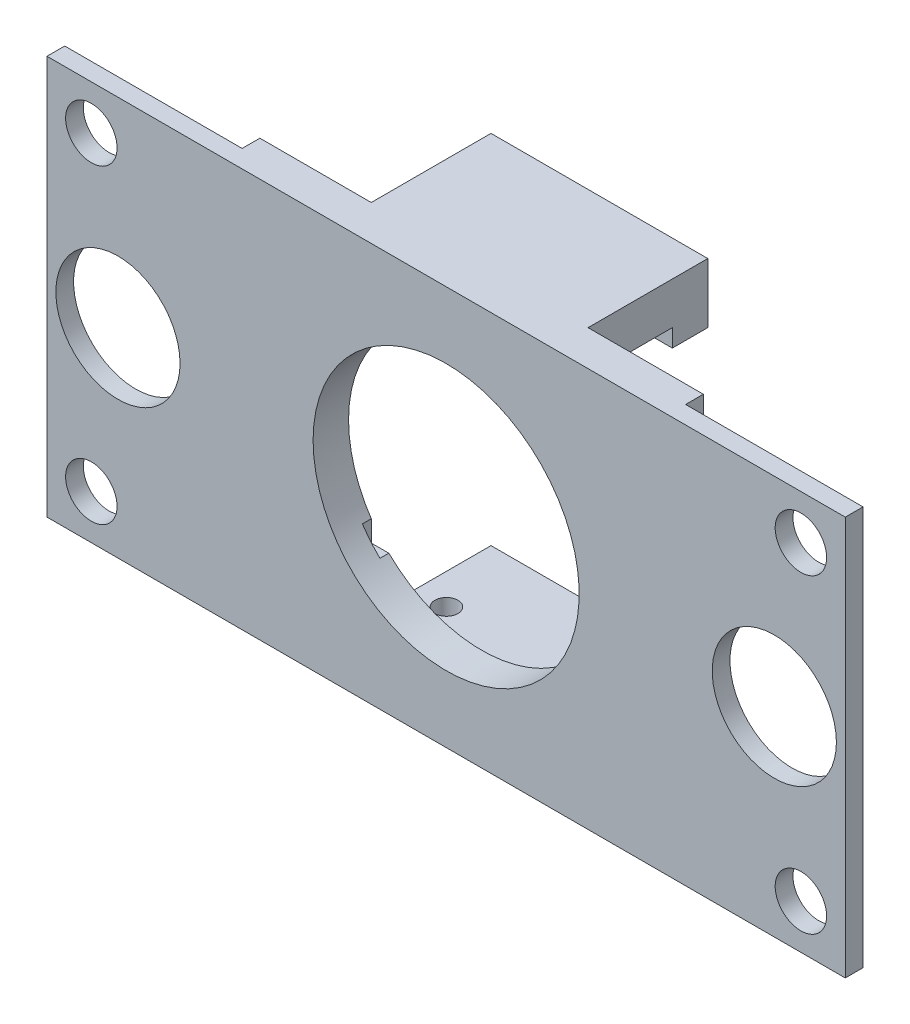
ISO-10303-21;
HEADER;
FILE_DESCRIPTION(('STEP AP214'),'2;1');
FILE_NAME('part.step','',(''),(''),'','','');
FILE_SCHEMA(('AUTOMOTIVE_DESIGN { 1 0 10303 214 1 1 1 1 }'));
ENDSEC;
DATA;
#1=APPLICATION_CONTEXT('core data for automotive mechanical design processes');
#2=APPLICATION_PROTOCOL_DEFINITION('international standard','automotive_design',2000,#1);
#3=PRODUCT_CONTEXT('',#1,'mechanical');
#4=PRODUCT('Part','Part','',(#3));
#5=PRODUCT_RELATED_PRODUCT_CATEGORY('part','',(#4));
#6=PRODUCT_DEFINITION_FORMATION('','',#4);
#7=PRODUCT_DEFINITION_CONTEXT('part definition',#1,'design');
#8=PRODUCT_DEFINITION('design','',#6,#7);
#9=PRODUCT_DEFINITION_SHAPE('','',#8);
#10=(LENGTH_UNIT() NAMED_UNIT(*) SI_UNIT(.MILLI.,.METRE.));
#11=(NAMED_UNIT(*) PLANE_ANGLE_UNIT() SI_UNIT($,.RADIAN.));
#12=(NAMED_UNIT(*) SI_UNIT($,.STERADIAN.) SOLID_ANGLE_UNIT());
#13=UNCERTAINTY_MEASURE_WITH_UNIT(LENGTH_MEASURE(1.E-05),#10,'distance_accuracy_value','');
#14=(GEOMETRIC_REPRESENTATION_CONTEXT(3) GLOBAL_UNCERTAINTY_ASSIGNED_CONTEXT((#13)) GLOBAL_UNIT_ASSIGNED_CONTEXT((#10,
#11,#12)) REPRESENTATION_CONTEXT('',''));
#15=CARTESIAN_POINT('',(0.,0.,0.));
#16=DIRECTION('',(0.,0.,1.));
#17=DIRECTION('',(1.,0.,0.));
#18=AXIS2_PLACEMENT_3D('',#15,#16,#17);
#19=CARTESIAN_POINT('',(0.,17.75,-17.5));
#20=DIRECTION('',(0.,1.,0.));
#21=DIRECTION('',(0.,0.,1.));
#22=AXIS2_PLACEMENT_3D('',#19,#20,#21);
#23=PLANE('',#22);
#24=DIRECTION('',(-1.,0.,0.));
#25=VECTOR('',#24,1.);
#26=CARTESIAN_POINT('',(-12.44124124824,17.75,-13.5));
#27=LINE('',#26,#25);
#28=CARTESIAN_POINT('',(12.,17.75,-13.5));
#29=VERTEX_POINT('',#28);
#30=CARTESIAN_POINT('',(-12.44124124824,17.75,-13.5));
#31=VERTEX_POINT('',#30);
#32=EDGE_CURVE('E225',#29,#31,#27,.T.);
#33=ORIENTED_EDGE('',*,*,#32,.F.);
#34=DIRECTION('',(0.,0.,1.));
#35=VECTOR('',#34,1.);
#36=CARTESIAN_POINT('',(12.,17.75,-17.5));
#37=LINE('',#36,#35);
#38=CARTESIAN_POINT('',(12.,17.75,-4.));
#39=VERTEX_POINT('',#38);
#40=EDGE_CURVE('E52',#29,#39,#37,.T.);
#41=ORIENTED_EDGE('',*,*,#40,.T.);
#42=DIRECTION('',(-1.,0.,0.));
#43=VECTOR('',#42,1.);
#44=CARTESIAN_POINT('',(0.,17.75,-4.));
#45=LINE('',#44,#43);
#46=CARTESIAN_POINT('',(-12.44124124824,17.75,-4.));
#47=VERTEX_POINT('',#46);
#48=EDGE_CURVE('E242',#39,#47,#45,.T.);
#49=ORIENTED_EDGE('',*,*,#48,.T.);
#50=DIRECTION('',(0.,0.,1.));
#51=VECTOR('',#50,1.);
#52=CARTESIAN_POINT('',(-12.44124124824,17.75,-17.5));
#53=LINE('',#52,#51);
#54=EDGE_CURVE('E60',#31,#47,#53,.T.);
#55=ORIENTED_EDGE('',*,*,#54,.F.);
#56=EDGE_LOOP('',(#33,#41,#49,#55));
#57=FACE_BOUND('',#56,.T.);
#58=ADVANCED_FACE('F37',(#57),#23,.F.);
#59=CARTESIAN_POINT('',(0.,0.,-4.));
#60=DIRECTION('',(0.,0.,1.));
#61=DIRECTION('',(1.,0.,0.));
#62=AXIS2_PLACEMENT_3D('',#59,#60,#61);
#63=PLANE('',#62);
#64=DIRECTION('',(0.,-1.,0.));
#65=VECTOR('',#64,1.);
#66=CARTESIAN_POINT('',(-12.44124124824,0.,-4.));
#67=LINE('',#66,#65);
#68=CARTESIAN_POINT('',(-12.44124124824,-8.37946992375366,-4.));
#69=VERTEX_POINT('',#68);
#70=CARTESIAN_POINT('',(-12.44124124824,-10.75,-4.));
#71=VERTEX_POINT('',#70);
#72=EDGE_CURVE('E291',#69,#71,#67,.T.);
#73=ORIENTED_EDGE('',*,*,#72,.T.);
#74=DIRECTION('',(-1.,0.,0.));
#75=VECTOR('',#74,1.);
#76=CARTESIAN_POINT('',(0.,-10.75,-4.));
#77=LINE('',#76,#75);
#78=CARTESIAN_POINT('',(-10.4612379764538,-10.75,-4.));
#79=VERTEX_POINT('',#78);
#80=EDGE_CURVE('E308',#79,#71,#77,.T.);
#81=ORIENTED_EDGE('',*,*,#80,.F.);
#82=CARTESIAN_POINT('',(0.,0.,-4.));
#83=DIRECTION('',(0.,0.,-1.));
#84=DIRECTION('',(-1.,0.,0.));
#85=AXIS2_PLACEMENT_3D('',#82,#83,#84);
#86=CIRCLE('',#85,15.);
#87=CARTESIAN_POINT('',(10.4612379764538,-10.75,-4.));
#88=VERTEX_POINT('',#87);
#89=EDGE_CURVE('E319',#88,#79,#86,.T.);
#90=ORIENTED_EDGE('',*,*,#89,.F.);
#91=CARTESIAN_POINT('',(12.,-10.75,-4.));
#92=VERTEX_POINT('',#91);
#93=EDGE_CURVE('E296',#92,#88,#77,.T.);
#94=ORIENTED_EDGE('',*,*,#93,.F.);
#95=DIRECTION('',(0.,1.,0.));
#96=VECTOR('',#95,1.);
#97=CARTESIAN_POINT('',(12.,0.,-4.));
#98=LINE('',#97,#96);
#99=CARTESIAN_POINT('',(12.,-9.,-4.));
#100=VERTEX_POINT('',#99);
#101=EDGE_CURVE('E305',#92,#100,#98,.T.);
#102=ORIENTED_EDGE('',*,*,#101,.T.);
#103=EDGE_CURVE('E313',#69,#100,#86,.T.);
#104=ORIENTED_EDGE('',*,*,#103,.F.);
#105=EDGE_LOOP('',(#73,#81,#90,#94,#102,#104));
#106=FACE_BOUND('',#105,.T.);
#107=DIRECTION('',(0.,-1.,0.));
#108=VECTOR('',#107,1.);
#109=CARTESIAN_POINT('',(12.,0.,-4.));
#110=LINE('',#109,#108);
#111=CARTESIAN_POINT('',(12.,22.5,-4.));
#112=VERTEX_POINT('',#111);
#113=EDGE_CURVE('E235',#112,#39,#110,.T.);
#114=ORIENTED_EDGE('',*,*,#113,.F.);
#115=DIRECTION('',(1.,0.,0.));
#116=VECTOR('',#115,1.);
#117=CARTESIAN_POINT('',(25.,22.5,-4.));
#118=LINE('',#117,#116);
#119=CARTESIAN_POINT('',(25.,22.5,-4.));
#120=VERTEX_POINT('',#119);
#121=EDGE_CURVE('E328',#112,#120,#118,.T.);
#122=ORIENTED_EDGE('',*,*,#121,.T.);
#123=DIRECTION('',(0.,-1.,0.));
#124=VECTOR('',#123,1.);
#125=CARTESIAN_POINT('',(25.,-22.5,-4.));
#126=LINE('',#125,#124);
#127=CARTESIAN_POINT('',(25.,-22.5,-4.));
#128=VERTEX_POINT('',#127);
#129=EDGE_CURVE('E331',#120,#128,#126,.T.);
#130=ORIENTED_EDGE('',*,*,#129,.T.);
#131=DIRECTION('',(-1.,0.,0.));
#132=VECTOR('',#131,1.);
#133=CARTESIAN_POINT('',(-25.,-22.5,-4.));
#134=LINE('',#133,#132);
#135=CARTESIAN_POINT('',(12.,-22.5,-4.));
#136=VERTEX_POINT('',#135);
#137=EDGE_CURVE('E322',#128,#136,#134,.T.);
#138=ORIENTED_EDGE('',*,*,#137,.T.);
#139=DIRECTION('',(0.,1.,0.));
#140=VECTOR('',#139,1.);
#141=CARTESIAN_POINT('',(12.,0.,-4.));
#142=LINE('',#141,#140);
#143=CARTESIAN_POINT('',(12.,-17.75,-4.));
#144=VERTEX_POINT('',#143);
#145=EDGE_CURVE('E278',#136,#144,#142,.T.);
#146=ORIENTED_EDGE('',*,*,#145,.T.);
#147=DIRECTION('',(-1.,0.,0.));
#148=VECTOR('',#147,1.);
#149=CARTESIAN_POINT('',(0.,-17.75,-4.));
#150=LINE('',#149,#148);
#151=CARTESIAN_POINT('',(-12.44124124824,-17.75,-4.));
#152=VERTEX_POINT('',#151);
#153=EDGE_CURVE('E260',#144,#152,#150,.T.);
#154=ORIENTED_EDGE('',*,*,#153,.T.);
#155=DIRECTION('',(0.,-1.,0.));
#156=VECTOR('',#155,1.);
#157=CARTESIAN_POINT('',(-12.44124124824,0.,-4.));
#158=LINE('',#157,#156);
#159=CARTESIAN_POINT('',(-12.44124124824,-22.5,-4.));
#160=VERTEX_POINT('',#159);
#161=EDGE_CURVE('E267',#152,#160,#158,.T.);
#162=ORIENTED_EDGE('',*,*,#161,.T.);
#163=CARTESIAN_POINT('',(-25.,-22.5,-4.));
#164=VERTEX_POINT('',#163);
#165=EDGE_CURVE('E326',#160,#164,#134,.T.);
#166=ORIENTED_EDGE('',*,*,#165,.T.);
#167=DIRECTION('',(0.,1.,0.));
#168=VECTOR('',#167,1.);
#169=CARTESIAN_POINT('',(-25.,22.5,-4.));
#170=LINE('',#169,#168);
#171=CARTESIAN_POINT('',(-25.,22.5,-4.));
#172=VERTEX_POINT('',#171);
#173=EDGE_CURVE('E325',#164,#172,#170,.T.);
#174=ORIENTED_EDGE('',*,*,#173,.T.);
#175=CARTESIAN_POINT('',(-12.44124124824,22.5,-4.));
#176=VERTEX_POINT('',#175);
#177=EDGE_CURVE('E329',#172,#176,#118,.T.);
#178=ORIENTED_EDGE('',*,*,#177,.T.);
#179=DIRECTION('',(0.,1.,0.));
#180=VECTOR('',#179,1.);
#181=CARTESIAN_POINT('',(-12.44124124824,0.,-4.));
#182=LINE('',#181,#180);
#183=EDGE_CURVE('E236',#47,#176,#182,.T.);
#184=ORIENTED_EDGE('',*,*,#183,.F.);
#185=ORIENTED_EDGE('',*,*,#48,.F.);
#186=EDGE_LOOP('',(#114,#122,#130,#138,#146,#154,#162,#166,#174,#178,#184,#185));
#187=FACE_BOUND('',#186,.T.);
#188=ADVANCED_FACE('F444',(#106,#187),#63,.F.);
#189=CARTESIAN_POINT('',(0.,0.,0.));
#190=DIRECTION('',(0.,0.,-1.));
#191=DIRECTION('',(-1.,0.,0.));
#192=AXIS2_PLACEMENT_3D('',#189,#190,#191);
#193=CYLINDRICAL_SURFACE('',#192,15.);
#194=CARTESIAN_POINT('',(0.,0.,0.));
#195=DIRECTION('',(0.,0.,-1.));
#196=DIRECTION('',(-1.,0.,0.));
#197=AXIS2_PLACEMENT_3D('',#194,#195,#196);
#198=CIRCLE('',#197,15.);
#199=CARTESIAN_POINT('',(-15.,0.,0.));
#200=VERTEX_POINT('',#199);
#201=EDGE_CURVE('E315',#200,#200,#198,.T.);
#202=ORIENTED_EDGE('',*,*,#201,.F.);
#203=EDGE_LOOP('',(#202));
#204=FACE_BOUND('',#203,.T.);
#205=DIRECTION('',(0.,0.,-1.));
#206=VECTOR('',#205,1.);
#207=CARTESIAN_POINT('',(-12.44124124824,-8.37946992375366,0.));
#208=LINE('',#207,#206);
#209=CARTESIAN_POINT('',(-12.44124124824,-8.37946992375366,-3.));
#210=VERTEX_POINT('',#209);
#211=EDGE_CURVE('E11',#69,#210,#208,.F.);
#212=ORIENTED_EDGE('',*,*,#211,.F.);
#213=ORIENTED_EDGE('',*,*,#103,.T.);
#214=DIRECTION('',(0.,0.,-1.));
#215=VECTOR('',#214,1.);
#216=CARTESIAN_POINT('',(12.,-9.,0.));
#217=LINE('',#216,#215);
#218=CARTESIAN_POINT('',(12.,-9.,-3.));
#219=VERTEX_POINT('',#218);
#220=EDGE_CURVE('E423',#219,#100,#217,.T.);
#221=ORIENTED_EDGE('',*,*,#220,.F.);
#222=CARTESIAN_POINT('',(0.,0.,-3.));
#223=DIRECTION('',(0.,0.,-1.));
#224=DIRECTION('',(-1.,0.,0.));
#225=AXIS2_PLACEMENT_3D('',#222,#223,#224);
#226=CIRCLE('',#225,15.);
#227=CARTESIAN_POINT('',(10.4612379764538,-10.75,-3.));
#228=VERTEX_POINT('',#227);
#229=EDGE_CURVE('E416',#228,#219,#226,.F.);
#230=ORIENTED_EDGE('',*,*,#229,.F.);
#231=DIRECTION('',(0.,0.,-1.));
#232=VECTOR('',#231,1.);
#233=CARTESIAN_POINT('',(10.4612379764538,-10.75,0.));
#234=LINE('',#233,#232);
#235=EDGE_CURVE('E426',#228,#88,#234,.T.);
#236=ORIENTED_EDGE('',*,*,#235,.T.);
#237=ORIENTED_EDGE('',*,*,#89,.T.);
#238=DIRECTION('',(0.,0.,-1.));
#239=VECTOR('',#238,1.);
#240=CARTESIAN_POINT('',(-10.4612379764538,-10.75,0.));
#241=LINE('',#240,#239);
#242=CARTESIAN_POINT('',(-10.4612379764538,-10.75,-3.));
#243=VERTEX_POINT('',#242);
#244=EDGE_CURVE('E45',#79,#243,#241,.F.);
#245=ORIENTED_EDGE('',*,*,#244,.T.);
#246=EDGE_CURVE('E424',#210,#243,#226,.F.);
#247=ORIENTED_EDGE('',*,*,#246,.F.);
#248=EDGE_LOOP('',(#212,#213,#221,#230,#236,#237,#245,#247));
#249=FACE_BOUND('',#248,.T.);
#250=ADVANCED_FACE('F450',(#204,#249),#193,.F.);
#251=CARTESIAN_POINT('',(0.,0.,-2.));
#252=DIRECTION('',(0.,0.,1.));
#253=DIRECTION('',(1.,0.,0.));
#254=AXIS2_PLACEMENT_3D('',#251,#252,#253);
#255=PLANE('',#254);
#256=CARTESIAN_POINT('',(-40.,17.5,-2.));
#257=DIRECTION('',(0.,0.,1.));
#258=DIRECTION('',(1.,0.,0.));
#259=AXIS2_PLACEMENT_3D('',#256,#257,#258);
#260=CIRCLE('',#259,2.9);
#261=CARTESIAN_POINT('',(-37.1,17.5,-2.));
#262=VERTEX_POINT('',#261);
#263=EDGE_CURVE('E382',#262,#262,#260,.T.);
#264=ORIENTED_EDGE('',*,*,#263,.T.);
#265=EDGE_LOOP('',(#264));
#266=FACE_BOUND('',#265,.T.);
#267=CARTESIAN_POINT('',(-40.,-17.5000000000001,-2.));
#268=DIRECTION('',(0.,0.,1.));
#269=DIRECTION('',(1.,0.,0.));
#270=AXIS2_PLACEMENT_3D('',#267,#268,#269);
#271=CIRCLE('',#270,2.9);
#272=CARTESIAN_POINT('',(-37.1,-17.5000000000001,-2.));
#273=VERTEX_POINT('',#272);
#274=EDGE_CURVE('E376',#273,#273,#271,.T.);
#275=ORIENTED_EDGE('',*,*,#274,.T.);
#276=EDGE_LOOP('',(#275));
#277=FACE_BOUND('',#276,.T.);
#278=CARTESIAN_POINT('',(-37.,0.,-2.));
#279=DIRECTION('',(0.,0.,1.));
#280=DIRECTION('',(1.,0.,0.));
#281=AXIS2_PLACEMENT_3D('',#278,#279,#280);
#282=CIRCLE('',#281,7.);
#283=CARTESIAN_POINT('',(-30.,0.,-2.));
#284=VERTEX_POINT('',#283);
#285=EDGE_CURVE('E358',#284,#284,#282,.T.);
#286=ORIENTED_EDGE('',*,*,#285,.T.);
#287=EDGE_LOOP('',(#286));
#288=FACE_BOUND('',#287,.T.);
#289=DIRECTION('',(0.,1.,0.));
#290=VECTOR('',#289,1.);
#291=CARTESIAN_POINT('',(-25.,22.5,-2.));
#292=LINE('',#291,#290);
#293=CARTESIAN_POINT('',(-25.,-22.5,-2.));
#294=VERTEX_POINT('',#293);
#295=CARTESIAN_POINT('',(-25.,22.5,-2.));
#296=VERTEX_POINT('',#295);
#297=EDGE_CURVE('E318',#294,#296,#292,.T.);
#298=ORIENTED_EDGE('',*,*,#297,.F.);
#299=DIRECTION('',(1.,0.,0.));
#300=VECTOR('',#299,1.);
#301=CARTESIAN_POINT('',(-45.,-22.5,-2.));
#302=LINE('',#301,#300);
#303=CARTESIAN_POINT('',(-45.,-22.5,-2.));
#304=VERTEX_POINT('',#303);
#305=EDGE_CURVE('E400',#304,#294,#302,.T.);
#306=ORIENTED_EDGE('',*,*,#305,.F.);
#307=DIRECTION('',(0.,-1.,0.));
#308=VECTOR('',#307,1.);
#309=CARTESIAN_POINT('',(-45.,22.5,-2.));
#310=LINE('',#309,#308);
#311=CARTESIAN_POINT('',(-45.,22.5,-2.));
#312=VERTEX_POINT('',#311);
#313=EDGE_CURVE('E396',#312,#304,#310,.T.);
#314=ORIENTED_EDGE('',*,*,#313,.F.);
#315=DIRECTION('',(-1.,0.,0.));
#316=VECTOR('',#315,1.);
#317=CARTESIAN_POINT('',(-45.,22.5,-2.));
#318=LINE('',#317,#316);
#319=EDGE_CURVE('E391',#296,#312,#318,.T.);
#320=ORIENTED_EDGE('',*,*,#319,.F.);
#321=EDGE_LOOP('',(#298,#306,#314,#320));
#322=FACE_BOUND('',#321,.T.);
#323=ADVANCED_FACE('F550',(#266,#277,#288,#322),#255,.F.);
#324=CARTESIAN_POINT('',(40.0000000000001,17.5,-2.));
#325=DIRECTION('',(0.,0.,1.));
#326=DIRECTION('',(1.,0.,0.));
#327=AXIS2_PLACEMENT_3D('',#324,#325,#326);
#328=CIRCLE('',#327,2.9);
#329=CARTESIAN_POINT('',(42.9000000000001,17.5,-2.));
#330=VERTEX_POINT('',#329);
#331=EDGE_CURVE('E370',#330,#330,#328,.T.);
#332=ORIENTED_EDGE('',*,*,#331,.T.);
#333=EDGE_LOOP('',(#332));
#334=FACE_BOUND('',#333,.T.);
#335=CARTESIAN_POINT('',(40.0000000000001,-17.5000000000001,-2.));
#336=DIRECTION('',(0.,0.,1.));
#337=DIRECTION('',(1.,0.,0.));
#338=AXIS2_PLACEMENT_3D('',#335,#336,#337);
#339=CIRCLE('',#338,2.9);
#340=CARTESIAN_POINT('',(42.9000000000001,-17.5000000000001,-2.));
#341=VERTEX_POINT('',#340);
#342=EDGE_CURVE('E364',#341,#341,#339,.T.);
#343=ORIENTED_EDGE('',*,*,#342,.T.);
#344=EDGE_LOOP('',(#343));
#345=FACE_BOUND('',#344,.T.);
#346=CARTESIAN_POINT('',(37.,0.,-2.));
#347=DIRECTION('',(0.,0.,1.));
#348=DIRECTION('',(1.,0.,0.));
#349=AXIS2_PLACEMENT_3D('',#346,#347,#348);
#350=CIRCLE('',#349,7.);
#351=CARTESIAN_POINT('',(44.,0.,-2.));
#352=VERTEX_POINT('',#351);
#353=EDGE_CURVE('E352',#352,#352,#350,.T.);
#354=ORIENTED_EDGE('',*,*,#353,.T.);
#355=EDGE_LOOP('',(#354));
#356=FACE_BOUND('',#355,.T.);
#357=DIRECTION('',(0.,-1.,0.));
#358=VECTOR('',#357,1.);
#359=CARTESIAN_POINT('',(25.,-22.5,-2.));
#360=LINE('',#359,#358);
#361=CARTESIAN_POINT('',(25.,22.5,-2.));
#362=VERTEX_POINT('',#361);
#363=CARTESIAN_POINT('',(25.,-22.5,-2.));
#364=VERTEX_POINT('',#363);
#365=EDGE_CURVE('E337',#362,#364,#360,.T.);
#366=ORIENTED_EDGE('',*,*,#365,.F.);
#367=CARTESIAN_POINT('',(45.,22.5,-2.));
#368=VERTEX_POINT('',#367);
#369=EDGE_CURVE('E393',#368,#362,#318,.T.);
#370=ORIENTED_EDGE('',*,*,#369,.F.);
#371=DIRECTION('',(0.,1.,0.));
#372=VECTOR('',#371,1.);
#373=CARTESIAN_POINT('',(45.,22.5,-2.));
#374=LINE('',#373,#372);
#375=CARTESIAN_POINT('',(45.,-22.5,-2.));
#376=VERTEX_POINT('',#375);
#377=EDGE_CURVE('E388',#376,#368,#374,.T.);
#378=ORIENTED_EDGE('',*,*,#377,.F.);
#379=EDGE_CURVE('E399',#364,#376,#302,.T.);
#380=ORIENTED_EDGE('',*,*,#379,.F.);
#381=EDGE_LOOP('',(#366,#370,#378,#380));
#382=FACE_BOUND('',#381,.T.);
#383=ADVANCED_FACE('F553',(#334,#345,#356,#382),#255,.F.);
#384=CARTESIAN_POINT('',(45.,22.5,-2.));
#385=DIRECTION('',(1.,0.,0.));
#386=DIRECTION('',(0.,0.,-1.));
#387=AXIS2_PLACEMENT_3D('',#384,#385,#386);
#388=PLANE('',#387);
#389=DIRECTION('',(0.,1.,0.));
#390=VECTOR('',#389,1.);
#391=CARTESIAN_POINT('',(45.,22.5,0.));
#392=LINE('',#391,#390);
#393=CARTESIAN_POINT('',(45.,-22.5,0.));
#394=VERTEX_POINT('',#393);
#395=CARTESIAN_POINT('',(45.,22.5,0.));
#396=VERTEX_POINT('',#395);
#397=EDGE_CURVE('E385',#394,#396,#392,.T.);
#398=ORIENTED_EDGE('',*,*,#397,.F.);
#399=DIRECTION('',(0.,0.,1.));
#400=VECTOR('',#399,1.);
#401=CARTESIAN_POINT('',(45.,-22.5,-2.));
#402=LINE('',#401,#400);
#403=EDGE_CURVE('E414',#376,#394,#402,.T.);
#404=ORIENTED_EDGE('',*,*,#403,.F.);
#405=ORIENTED_EDGE('',*,*,#377,.T.);
#406=DIRECTION('',(0.,0.,1.));
#407=VECTOR('',#406,1.);
#408=CARTESIAN_POINT('',(45.,22.5,-2.));
#409=LINE('',#408,#407);
#410=EDGE_CURVE('E403',#368,#396,#409,.T.);
#411=ORIENTED_EDGE('',*,*,#410,.T.);
#412=EDGE_LOOP('',(#398,#404,#405,#411));
#413=FACE_BOUND('',#412,.T.);
#414=ADVANCED_FACE('F39',(#413),#388,.T.);
#415=CARTESIAN_POINT('',(-45.,-22.5,-2.));
#416=DIRECTION('',(0.,-1.,0.));
#417=DIRECTION('',(0.,0.,-1.));
#418=AXIS2_PLACEMENT_3D('',#415,#416,#417);
#419=PLANE('',#418);
#420=CARTESIAN_POINT('',(8.52937937588001,-22.5,-9.));
#421=DIRECTION('',(0.,1.,0.));
#422=DIRECTION('',(0.,0.,1.));
#423=AXIS2_PLACEMENT_3D('',#420,#421,#422);
#424=CIRCLE('',#423,1.3);
#425=CARTESIAN_POINT('',(8.52937937588001,-22.5,-7.7));
#426=VERTEX_POINT('',#425);
#427=EDGE_CURVE('E251',#426,#426,#424,.T.);
#428=ORIENTED_EDGE('',*,*,#427,.T.);
#429=EDGE_LOOP('',(#428));
#430=FACE_BOUND('',#429,.T.);
#431=CARTESIAN_POINT('',(-8.97062062411999,-22.5,-9.));
#432=DIRECTION('',(0.,1.,0.));
#433=DIRECTION('',(0.,0.,1.));
#434=AXIS2_PLACEMENT_3D('',#431,#432,#433);
#435=CIRCLE('',#434,1.3);
#436=CARTESIAN_POINT('',(-8.97062062411999,-22.5,-7.7));
#437=VERTEX_POINT('',#436);
#438=EDGE_CURVE('E257',#437,#437,#435,.T.);
#439=ORIENTED_EDGE('',*,*,#438,.T.);
#440=EDGE_LOOP('',(#439));
#441=FACE_BOUND('',#440,.T.);
#442=DIRECTION('',(1.,0.,0.));
#443=VECTOR('',#442,1.);
#444=CARTESIAN_POINT('',(-45.,-22.5,0.));
#445=LINE('',#444,#443);
#446=CARTESIAN_POINT('',(-45.,-22.5,0.));
#447=VERTEX_POINT('',#446);
#448=EDGE_CURVE('E392',#447,#394,#445,.T.);
#449=ORIENTED_EDGE('',*,*,#448,.F.);
#450=DIRECTION('',(0.,0.,1.));
#451=VECTOR('',#450,1.);
#452=CARTESIAN_POINT('',(-45.,-22.5,-2.));
#453=LINE('',#452,#451);
#454=EDGE_CURVE('E417',#304,#447,#453,.T.);
#455=ORIENTED_EDGE('',*,*,#454,.F.);
#456=ORIENTED_EDGE('',*,*,#305,.T.);
#457=DIRECTION('',(0.,0.,1.));
#458=VECTOR('',#457,1.);
#459=CARTESIAN_POINT('',(-25.,-22.5,-4.));
#460=LINE('',#459,#458);
#461=EDGE_CURVE('E348',#164,#294,#460,.T.);
#462=ORIENTED_EDGE('',*,*,#461,.F.);
#463=ORIENTED_EDGE('',*,*,#165,.F.);
#464=DIRECTION('',(0.,0.,1.));
#465=VECTOR('',#464,1.);
#466=CARTESIAN_POINT('',(-12.44124124824,-22.5,-17.5));
#467=LINE('',#466,#465);
#468=CARTESIAN_POINT('',(-12.44124124824,-22.5,-17.5));
#469=VERTEX_POINT('',#468);
#470=EDGE_CURVE('E284',#469,#160,#467,.T.);
#471=ORIENTED_EDGE('',*,*,#470,.F.);
#472=DIRECTION('',(-1.,0.,0.));
#473=VECTOR('',#472,1.);
#474=CARTESIAN_POINT('',(0.,-22.5,-17.5));
#475=LINE('',#474,#473);
#476=CARTESIAN_POINT('',(12.,-22.5,-17.5));
#477=VERTEX_POINT('',#476);
#478=EDGE_CURVE('E270',#477,#469,#475,.T.);
#479=ORIENTED_EDGE('',*,*,#478,.F.);
#480=DIRECTION('',(0.,0.,1.));
#481=VECTOR('',#480,1.);
#482=CARTESIAN_POINT('',(12.,-22.5,-17.5));
#483=LINE('',#482,#481);
#484=EDGE_CURVE('E286',#477,#136,#483,.T.);
#485=ORIENTED_EDGE('',*,*,#484,.T.);
#486=ORIENTED_EDGE('',*,*,#137,.F.);
#487=DIRECTION('',(0.,0.,1.));
#488=VECTOR('',#487,1.);
#489=CARTESIAN_POINT('',(25.,-22.5,-4.));
#490=LINE('',#489,#488);
#491=EDGE_CURVE('E334',#128,#364,#490,.T.);
#492=ORIENTED_EDGE('',*,*,#491,.T.);
#493=ORIENTED_EDGE('',*,*,#379,.T.);
#494=ORIENTED_EDGE('',*,*,#403,.T.);
#495=EDGE_LOOP('',(#449,#455,#456,#462,#463,#471,#479,#485,#486,#492,#493,#494));
#496=FACE_BOUND('',#495,.T.);
#497=ADVANCED_FACE('F559',(#430,#441,#496),#419,.T.);
#498=CARTESIAN_POINT('',(-45.,22.5,-2.));
#499=DIRECTION('',(-1.,0.,0.));
#500=DIRECTION('',(0.,-1.,0.));
#501=AXIS2_PLACEMENT_3D('',#498,#499,#500);
#502=PLANE('',#501);
#503=DIRECTION('',(0.,-1.,0.));
#504=VECTOR('',#503,1.);
#505=CARTESIAN_POINT('',(-45.,22.5,0.));
#506=LINE('',#505,#504);
#507=CARTESIAN_POINT('',(-45.,22.5,0.));
#508=VERTEX_POINT('',#507);
#509=EDGE_CURVE('E409',#508,#447,#506,.T.);
#510=ORIENTED_EDGE('',*,*,#509,.F.);
#511=DIRECTION('',(0.,0.,1.));
#512=VECTOR('',#511,1.);
#513=CARTESIAN_POINT('',(-45.,22.5,-2.));
#514=LINE('',#513,#512);
#515=EDGE_CURVE('E419',#312,#508,#514,.T.);
#516=ORIENTED_EDGE('',*,*,#515,.F.);
#517=ORIENTED_EDGE('',*,*,#313,.T.);
#518=ORIENTED_EDGE('',*,*,#454,.T.);
#519=EDGE_LOOP('',(#510,#516,#517,#518));
#520=FACE_BOUND('',#519,.T.);
#521=ADVANCED_FACE('F562',(#520),#502,.T.);
#522=CARTESIAN_POINT('',(-45.,22.5,-2.));
#523=DIRECTION('',(0.,1.,0.));
#524=DIRECTION('',(0.,0.,1.));
#525=AXIS2_PLACEMENT_3D('',#522,#523,#524);
#526=PLANE('',#525);
#527=DIRECTION('',(-1.,0.,0.));
#528=VECTOR('',#527,1.);
#529=CARTESIAN_POINT('',(-45.,22.5,0.));
#530=LINE('',#529,#528);
#531=EDGE_CURVE('E406',#396,#508,#530,.T.);
#532=ORIENTED_EDGE('',*,*,#531,.F.);
#533=ORIENTED_EDGE('',*,*,#410,.F.);
#534=ORIENTED_EDGE('',*,*,#369,.T.);
#535=DIRECTION('',(0.,0.,1.));
#536=VECTOR('',#535,1.);
#537=CARTESIAN_POINT('',(25.,22.5,-4.));
#538=LINE('',#537,#536);
#539=EDGE_CURVE('E342',#120,#362,#538,.T.);
#540=ORIENTED_EDGE('',*,*,#539,.F.);
#541=ORIENTED_EDGE('',*,*,#121,.F.);
#542=DIRECTION('',(0.,0.,1.));
#543=VECTOR('',#542,1.);
#544=CARTESIAN_POINT('',(12.,22.5,-17.5));
#545=LINE('',#544,#543);
#546=CARTESIAN_POINT('',(12.,22.5,-17.5));
#547=VERTEX_POINT('',#546);
#548=EDGE_CURVE('E239',#547,#112,#545,.T.);
#549=ORIENTED_EDGE('',*,*,#548,.F.);
#550=DIRECTION('',(1.,0.,0.));
#551=VECTOR('',#550,1.);
#552=CARTESIAN_POINT('',(0.,22.5,-17.5));
#553=LINE('',#552,#551);
#554=CARTESIAN_POINT('',(-12.44124124824,22.5,-17.5));
#555=VERTEX_POINT('',#554);
#556=EDGE_CURVE('E210',#555,#547,#553,.T.);
#557=ORIENTED_EDGE('',*,*,#556,.F.);
#558=DIRECTION('',(0.,0.,1.));
#559=VECTOR('',#558,1.);
#560=CARTESIAN_POINT('',(-12.44124124824,22.5,-17.5));
#561=LINE('',#560,#559);
#562=EDGE_CURVE('E207',#555,#176,#561,.T.);
#563=ORIENTED_EDGE('',*,*,#562,.T.);
#564=ORIENTED_EDGE('',*,*,#177,.F.);
#565=DIRECTION('',(0.,0.,1.));
#566=VECTOR('',#565,1.);
#567=CARTESIAN_POINT('',(-25.,22.5,-4.));
#568=LINE('',#567,#566);
#569=EDGE_CURVE('E345',#172,#296,#568,.T.);
#570=ORIENTED_EDGE('',*,*,#569,.T.);
#571=ORIENTED_EDGE('',*,*,#319,.T.);
#572=ORIENTED_EDGE('',*,*,#515,.T.);
#573=EDGE_LOOP('',(#532,#533,#534,#540,#541,#549,#557,#563,#564,#570,#571,#572));
#574=FACE_BOUND('',#573,.T.);
#575=ADVANCED_FACE('F557',(#574),#526,.T.);
#576=CARTESIAN_POINT('',(0.,0.,0.));
#577=DIRECTION('',(0.,0.,1.));
#578=DIRECTION('',(1.,0.,0.));
#579=AXIS2_PLACEMENT_3D('',#576,#577,#578);
#580=PLANE('',#579);
#581=ORIENTED_EDGE('',*,*,#201,.T.);
#582=EDGE_LOOP('',(#581));
#583=FACE_BOUND('',#582,.T.);
#584=CARTESIAN_POINT('',(37.,0.,0.));
#585=DIRECTION('',(0.,0.,1.));
#586=DIRECTION('',(1.,0.,0.));
#587=AXIS2_PLACEMENT_3D('',#584,#585,#586);
#588=CIRCLE('',#587,7.);
#589=CARTESIAN_POINT('',(44.,0.,0.));
#590=VERTEX_POINT('',#589);
#591=EDGE_CURVE('E351',#590,#590,#588,.T.);
#592=ORIENTED_EDGE('',*,*,#591,.F.);
#593=EDGE_LOOP('',(#592));
#594=FACE_BOUND('',#593,.T.);
#595=CARTESIAN_POINT('',(-37.,0.,0.));
#596=DIRECTION('',(0.,0.,1.));
#597=DIRECTION('',(1.,0.,0.));
#598=AXIS2_PLACEMENT_3D('',#595,#596,#597);
#599=CIRCLE('',#598,7.);
#600=CARTESIAN_POINT('',(-30.,0.,0.));
#601=VERTEX_POINT('',#600);
#602=EDGE_CURVE('E355',#601,#601,#599,.T.);
#603=ORIENTED_EDGE('',*,*,#602,.F.);
#604=EDGE_LOOP('',(#603));
#605=FACE_BOUND('',#604,.T.);
#606=CARTESIAN_POINT('',(40.0000000000001,-17.5000000000001,0.));
#607=DIRECTION('',(0.,0.,1.));
#608=DIRECTION('',(1.,0.,0.));
#609=AXIS2_PLACEMENT_3D('',#606,#607,#608);
#610=CIRCLE('',#609,2.9);
#611=CARTESIAN_POINT('',(42.9000000000001,-17.5000000000001,0.));
#612=VERTEX_POINT('',#611);
#613=EDGE_CURVE('E361',#612,#612,#610,.T.);
#614=ORIENTED_EDGE('',*,*,#613,.F.);
#615=EDGE_LOOP('',(#614));
#616=FACE_BOUND('',#615,.T.);
#617=CARTESIAN_POINT('',(40.0000000000001,17.5,0.));
#618=DIRECTION('',(0.,0.,1.));
#619=DIRECTION('',(1.,0.,0.));
#620=AXIS2_PLACEMENT_3D('',#617,#618,#619);
#621=CIRCLE('',#620,2.9);
#622=CARTESIAN_POINT('',(42.9000000000001,17.5,0.));
#623=VERTEX_POINT('',#622);
#624=EDGE_CURVE('E367',#623,#623,#621,.T.);
#625=ORIENTED_EDGE('',*,*,#624,.F.);
#626=EDGE_LOOP('',(#625));
#627=FACE_BOUND('',#626,.T.);
#628=CARTESIAN_POINT('',(-40.,-17.5000000000001,0.));
#629=DIRECTION('',(0.,0.,1.));
#630=DIRECTION('',(1.,0.,0.));
#631=AXIS2_PLACEMENT_3D('',#628,#629,#630);
#632=CIRCLE('',#631,2.9);
#633=CARTESIAN_POINT('',(-37.1,-17.5000000000001,0.));
#634=VERTEX_POINT('',#633);
#635=EDGE_CURVE('E373',#634,#634,#632,.T.);
#636=ORIENTED_EDGE('',*,*,#635,.F.);
#637=EDGE_LOOP('',(#636));
#638=FACE_BOUND('',#637,.T.);
#639=CARTESIAN_POINT('',(-40.,17.5,0.));
#640=DIRECTION('',(0.,0.,1.));
#641=DIRECTION('',(1.,0.,0.));
#642=AXIS2_PLACEMENT_3D('',#639,#640,#641);
#643=CIRCLE('',#642,2.9);
#644=CARTESIAN_POINT('',(-37.1,17.5,0.));
#645=VERTEX_POINT('',#644);
#646=EDGE_CURVE('E379',#645,#645,#643,.T.);
#647=ORIENTED_EDGE('',*,*,#646,.F.);
#648=EDGE_LOOP('',(#647));
#649=FACE_BOUND('',#648,.T.);
#650=ORIENTED_EDGE('',*,*,#397,.T.);
#651=ORIENTED_EDGE('',*,*,#531,.T.);
#652=ORIENTED_EDGE('',*,*,#509,.T.);
#653=ORIENTED_EDGE('',*,*,#448,.T.);
#654=EDGE_LOOP('',(#650,#651,#652,#653));
#655=FACE_BOUND('',#654,.T.);
#656=ADVANCED_FACE('F548',(#583,#594,#605,#616,#627,#638,#649,#655),#580,.T.);
#657=CARTESIAN_POINT('',(-40.,17.5,-2.));
#658=DIRECTION('',(0.,0.,1.));
#659=DIRECTION('',(1.,0.,0.));
#660=AXIS2_PLACEMENT_3D('',#657,#658,#659);
#661=CYLINDRICAL_SURFACE('',#660,2.9);
#662=ORIENTED_EDGE('',*,*,#263,.F.);
#663=EDGE_LOOP('',(#662));
#664=FACE_BOUND('',#663,.T.);
#665=ORIENTED_EDGE('',*,*,#646,.T.);
#666=EDGE_LOOP('',(#665));
#667=FACE_BOUND('',#666,.T.);
#668=ADVANCED_FACE('F544',(#664,#667),#661,.F.);
#669=CARTESIAN_POINT('',(-40.,-17.5000000000001,-2.));
#670=DIRECTION('',(0.,0.,1.));
#671=DIRECTION('',(1.,0.,0.));
#672=AXIS2_PLACEMENT_3D('',#669,#670,#671);
#673=CYLINDRICAL_SURFACE('',#672,2.9);
#674=ORIENTED_EDGE('',*,*,#274,.F.);
#675=EDGE_LOOP('',(#674));
#676=FACE_BOUND('',#675,.T.);
#677=ORIENTED_EDGE('',*,*,#635,.T.);
#678=EDGE_LOOP('',(#677));
#679=FACE_BOUND('',#678,.T.);
#680=ADVANCED_FACE('F540',(#676,#679),#673,.F.);
#681=CARTESIAN_POINT('',(40.0000000000001,17.5,-2.));
#682=DIRECTION('',(0.,0.,1.));
#683=DIRECTION('',(1.,0.,0.));
#684=AXIS2_PLACEMENT_3D('',#681,#682,#683);
#685=CYLINDRICAL_SURFACE('',#684,2.9);
#686=ORIENTED_EDGE('',*,*,#331,.F.);
#687=EDGE_LOOP('',(#686));
#688=FACE_BOUND('',#687,.T.);
#689=ORIENTED_EDGE('',*,*,#624,.T.);
#690=EDGE_LOOP('',(#689));
#691=FACE_BOUND('',#690,.T.);
#692=ADVANCED_FACE('F536',(#688,#691),#685,.F.);
#693=CARTESIAN_POINT('',(40.0000000000001,-17.5000000000001,-2.));
#694=DIRECTION('',(0.,0.,1.));
#695=DIRECTION('',(1.,0.,0.));
#696=AXIS2_PLACEMENT_3D('',#693,#694,#695);
#697=CYLINDRICAL_SURFACE('',#696,2.9);
#698=ORIENTED_EDGE('',*,*,#342,.F.);
#699=EDGE_LOOP('',(#698));
#700=FACE_BOUND('',#699,.T.);
#701=ORIENTED_EDGE('',*,*,#613,.T.);
#702=EDGE_LOOP('',(#701));
#703=FACE_BOUND('',#702,.T.);
#704=ADVANCED_FACE('F532',(#700,#703),#697,.F.);
#705=CARTESIAN_POINT('',(-37.,0.,-2.));
#706=DIRECTION('',(0.,0.,1.));
#707=DIRECTION('',(1.,0.,0.));
#708=AXIS2_PLACEMENT_3D('',#705,#706,#707);
#709=CYLINDRICAL_SURFACE('',#708,7.);
#710=ORIENTED_EDGE('',*,*,#285,.F.);
#711=EDGE_LOOP('',(#710));
#712=FACE_BOUND('',#711,.T.);
#713=ORIENTED_EDGE('',*,*,#602,.T.);
#714=EDGE_LOOP('',(#713));
#715=FACE_BOUND('',#714,.T.);
#716=ADVANCED_FACE('F528',(#712,#715),#709,.F.);
#717=CARTESIAN_POINT('',(37.,0.,-2.));
#718=DIRECTION('',(0.,0.,1.));
#719=DIRECTION('',(1.,0.,0.));
#720=AXIS2_PLACEMENT_3D('',#717,#718,#719);
#721=CYLINDRICAL_SURFACE('',#720,7.);
#722=ORIENTED_EDGE('',*,*,#353,.F.);
#723=EDGE_LOOP('',(#722));
#724=FACE_BOUND('',#723,.T.);
#725=ORIENTED_EDGE('',*,*,#591,.T.);
#726=EDGE_LOOP('',(#725));
#727=FACE_BOUND('',#726,.T.);
#728=ADVANCED_FACE('F521',(#724,#727),#721,.F.);
#729=CARTESIAN_POINT('',(-25.,22.5,-4.));
#730=DIRECTION('',(1.,0.,0.));
#731=DIRECTION('',(0.,1.,0.));
#732=AXIS2_PLACEMENT_3D('',#729,#730,#731);
#733=PLANE('',#732);
#734=ORIENTED_EDGE('',*,*,#297,.T.);
#735=ORIENTED_EDGE('',*,*,#569,.F.);
#736=ORIENTED_EDGE('',*,*,#173,.F.);
#737=ORIENTED_EDGE('',*,*,#461,.T.);
#738=EDGE_LOOP('',(#734,#735,#736,#737));
#739=FACE_BOUND('',#738,.T.);
#740=ADVANCED_FACE('F515',(#739),#733,.F.);
#741=CARTESIAN_POINT('',(25.,-22.5,-4.));
#742=DIRECTION('',(-1.,0.,0.));
#743=DIRECTION('',(0.,-1.,0.));
#744=AXIS2_PLACEMENT_3D('',#741,#742,#743);
#745=PLANE('',#744);
#746=ORIENTED_EDGE('',*,*,#365,.T.);
#747=ORIENTED_EDGE('',*,*,#491,.F.);
#748=ORIENTED_EDGE('',*,*,#129,.F.);
#749=ORIENTED_EDGE('',*,*,#539,.T.);
#750=EDGE_LOOP('',(#746,#747,#748,#749));
#751=FACE_BOUND('',#750,.T.);
#752=ADVANCED_FACE('F511',(#751),#745,.F.);
#753=CARTESIAN_POINT('',(0.,0.,-3.));
#754=DIRECTION('',(0.,0.,-1.));
#755=DIRECTION('',(-1.,0.,0.));
#756=AXIS2_PLACEMENT_3D('',#753,#754,#755);
#757=PLANE('',#756);
#758=ORIENTED_EDGE('',*,*,#229,.T.);
#759=DIRECTION('',(0.,1.,0.));
#760=VECTOR('',#759,1.);
#761=CARTESIAN_POINT('',(12.,0.,-3.));
#762=LINE('',#761,#760);
#763=CARTESIAN_POINT('',(12.,-10.75,-3.));
#764=VERTEX_POINT('',#763);
#765=EDGE_CURVE('E295',#764,#219,#762,.T.);
#766=ORIENTED_EDGE('',*,*,#765,.F.);
#767=DIRECTION('',(-1.,0.,0.));
#768=VECTOR('',#767,1.);
#769=CARTESIAN_POINT('',(0.,-10.75,-3.));
#770=LINE('',#769,#768);
#771=EDGE_CURVE('E300',#764,#228,#770,.T.);
#772=ORIENTED_EDGE('',*,*,#771,.T.);
#773=EDGE_LOOP('',(#758,#766,#772));
#774=FACE_BOUND('',#773,.T.);
#775=ADVANCED_FACE('F457',(#774),#757,.T.);
#776=CARTESIAN_POINT('',(12.,0.,-3.));
#777=DIRECTION('',(-1.,0.,0.));
#778=DIRECTION('',(0.,0.,1.));
#779=AXIS2_PLACEMENT_3D('',#776,#777,#778);
#780=PLANE('',#779);
#781=ORIENTED_EDGE('',*,*,#220,.T.);
#782=ORIENTED_EDGE('',*,*,#101,.F.);
#783=DIRECTION('',(0.,0.,-1.));
#784=VECTOR('',#783,1.);
#785=CARTESIAN_POINT('',(12.,-10.75,-3.));
#786=LINE('',#785,#784);
#787=EDGE_CURVE('E302',#764,#92,#786,.T.);
#788=ORIENTED_EDGE('',*,*,#787,.F.);
#789=ORIENTED_EDGE('',*,*,#765,.T.);
#790=EDGE_LOOP('',(#781,#782,#788,#789));
#791=FACE_BOUND('',#790,.T.);
#792=ADVANCED_FACE('F453',(#791),#780,.T.);
#793=CARTESIAN_POINT('',(0.,-10.75,-3.));
#794=DIRECTION('',(0.,-1.,0.));
#795=DIRECTION('',(0.,0.,-1.));
#796=AXIS2_PLACEMENT_3D('',#793,#794,#795);
#797=PLANE('',#796);
#798=ORIENTED_EDGE('',*,*,#771,.F.);
#799=ORIENTED_EDGE('',*,*,#787,.T.);
#800=ORIENTED_EDGE('',*,*,#93,.T.);
#801=ORIENTED_EDGE('',*,*,#235,.F.);
#802=EDGE_LOOP('',(#798,#799,#800,#801));
#803=FACE_BOUND('',#802,.T.);
#804=ADVANCED_FACE('F460',(#803),#797,.F.);
#805=CARTESIAN_POINT('',(-12.44124124824,0.,-3.));
#806=DIRECTION('',(1.,0.,0.));
#807=DIRECTION('',(0.,0.,-1.));
#808=AXIS2_PLACEMENT_3D('',#805,#806,#807);
#809=PLANE('',#808);
#810=ORIENTED_EDGE('',*,*,#211,.T.);
#811=DIRECTION('',(0.,-1.,0.));
#812=VECTOR('',#811,1.);
#813=CARTESIAN_POINT('',(-12.44124124824,0.,-3.));
#814=LINE('',#813,#812);
#815=CARTESIAN_POINT('',(-12.44124124824,-10.75,-3.));
#816=VERTEX_POINT('',#815);
#817=EDGE_CURVE('E292',#210,#816,#814,.T.);
#818=ORIENTED_EDGE('',*,*,#817,.T.);
#819=DIRECTION('',(0.,0.,-1.));
#820=VECTOR('',#819,1.);
#821=CARTESIAN_POINT('',(-12.44124124824,-10.75,-3.));
#822=LINE('',#821,#820);
#823=EDGE_CURVE('E310',#816,#71,#822,.T.);
#824=ORIENTED_EDGE('',*,*,#823,.T.);
#825=ORIENTED_EDGE('',*,*,#72,.F.);
#826=EDGE_LOOP('',(#810,#818,#824,#825));
#827=FACE_BOUND('',#826,.T.);
#828=ADVANCED_FACE('F441',(#827),#809,.T.);
#829=ORIENTED_EDGE('',*,*,#80,.T.);
#830=ORIENTED_EDGE('',*,*,#823,.F.);
#831=EDGE_CURVE('E299',#243,#816,#770,.T.);
#832=ORIENTED_EDGE('',*,*,#831,.F.);
#833=ORIENTED_EDGE('',*,*,#244,.F.);
#834=EDGE_LOOP('',(#829,#830,#832,#833));
#835=FACE_BOUND('',#834,.T.);
#836=ADVANCED_FACE('F438',(#835),#797,.F.);
#837=ORIENTED_EDGE('',*,*,#246,.T.);
#838=ORIENTED_EDGE('',*,*,#831,.T.);
#839=ORIENTED_EDGE('',*,*,#817,.F.);
#840=EDGE_LOOP('',(#837,#838,#839));
#841=FACE_BOUND('',#840,.T.);
#842=ADVANCED_FACE('F434',(#841),#757,.T.);
#843=CARTESIAN_POINT('',(0.,-17.75,-17.5));
#844=DIRECTION('',(0.,1.,0.));
#845=DIRECTION('',(0.,0.,1.));
#846=AXIS2_PLACEMENT_3D('',#843,#844,#845);
#847=PLANE('',#846);
#848=CARTESIAN_POINT('',(8.52937937588001,-17.75,-9.));
#849=DIRECTION('',(0.,1.,0.));
#850=DIRECTION('',(0.,0.,1.));
#851=AXIS2_PLACEMENT_3D('',#848,#849,#850);
#852=CIRCLE('',#851,1.3);
#853=CARTESIAN_POINT('',(8.52937937588001,-17.75,-7.7));
#854=VERTEX_POINT('',#853);
#855=EDGE_CURVE('E250',#854,#854,#852,.T.);
#856=ORIENTED_EDGE('',*,*,#855,.F.);
#857=EDGE_LOOP('',(#856));
#858=FACE_BOUND('',#857,.T.);
#859=CARTESIAN_POINT('',(-8.97062062411999,-17.75,-9.));
#860=DIRECTION('',(0.,1.,0.));
#861=DIRECTION('',(0.,0.,1.));
#862=AXIS2_PLACEMENT_3D('',#859,#860,#861);
#863=CIRCLE('',#862,1.3);
#864=CARTESIAN_POINT('',(-8.97062062411999,-17.75,-7.7));
#865=VERTEX_POINT('',#864);
#866=EDGE_CURVE('E254',#865,#865,#863,.T.);
#867=ORIENTED_EDGE('',*,*,#866,.F.);
#868=EDGE_LOOP('',(#867));
#869=FACE_BOUND('',#868,.T.);
#870=ORIENTED_EDGE('',*,*,#153,.F.);
#871=DIRECTION('',(0.,0.,1.));
#872=VECTOR('',#871,1.);
#873=CARTESIAN_POINT('',(12.,-17.75,-17.5));
#874=LINE('',#873,#872);
#875=CARTESIAN_POINT('',(12.,-17.75,-17.5));
#876=VERTEX_POINT('',#875);
#877=EDGE_CURVE('E288',#876,#144,#874,.T.);
#878=ORIENTED_EDGE('',*,*,#877,.F.);
#879=DIRECTION('',(-1.,0.,0.));
#880=VECTOR('',#879,1.);
#881=CARTESIAN_POINT('',(0.,-17.75,-17.5));
#882=LINE('',#881,#880);
#883=CARTESIAN_POINT('',(-12.44124124824,-17.75,-17.5));
#884=VERTEX_POINT('',#883);
#885=EDGE_CURVE('E263',#876,#884,#882,.T.);
#886=ORIENTED_EDGE('',*,*,#885,.T.);
#887=DIRECTION('',(0.,0.,1.));
#888=VECTOR('',#887,1.);
#889=CARTESIAN_POINT('',(-12.44124124824,-17.75,-17.5));
#890=LINE('',#889,#888);
#891=EDGE_CURVE('E275',#884,#152,#890,.T.);
#892=ORIENTED_EDGE('',*,*,#891,.T.);
#893=EDGE_LOOP('',(#870,#878,#886,#892));
#894=FACE_BOUND('',#893,.T.);
#895=ADVANCED_FACE('F503',(#858,#869,#894),#847,.T.);
#896=CARTESIAN_POINT('',(12.,0.,-17.5));
#897=DIRECTION('',(1.,0.,0.));
#898=DIRECTION('',(0.,0.,-1.));
#899=AXIS2_PLACEMENT_3D('',#896,#897,#898);
#900=PLANE('',#899);
#901=ORIENTED_EDGE('',*,*,#145,.F.);
#902=ORIENTED_EDGE('',*,*,#484,.F.);
#903=DIRECTION('',(0.,1.,0.));
#904=VECTOR('',#903,1.);
#905=CARTESIAN_POINT('',(12.,0.,-17.5));
#906=LINE('',#905,#904);
#907=EDGE_CURVE('E266',#477,#876,#906,.T.);
#908=ORIENTED_EDGE('',*,*,#907,.T.);
#909=ORIENTED_EDGE('',*,*,#877,.T.);
#910=EDGE_LOOP('',(#901,#902,#908,#909));
#911=FACE_BOUND('',#910,.T.);
#912=ADVANCED_FACE('F499',(#911),#900,.T.);
#913=CARTESIAN_POINT('',(-12.44124124824,0.,-17.5));
#914=DIRECTION('',(-1.,0.,0.));
#915=DIRECTION('',(0.,0.,1.));
#916=AXIS2_PLACEMENT_3D('',#913,#914,#915);
#917=PLANE('',#916);
#918=ORIENTED_EDGE('',*,*,#161,.F.);
#919=ORIENTED_EDGE('',*,*,#891,.F.);
#920=DIRECTION('',(0.,-1.,0.));
#921=VECTOR('',#920,1.);
#922=CARTESIAN_POINT('',(-12.44124124824,0.,-17.5));
#923=LINE('',#922,#921);
#924=EDGE_CURVE('E272',#884,#469,#923,.T.);
#925=ORIENTED_EDGE('',*,*,#924,.T.);
#926=ORIENTED_EDGE('',*,*,#470,.T.);
#927=EDGE_LOOP('',(#918,#919,#925,#926));
#928=FACE_BOUND('',#927,.T.);
#929=ADVANCED_FACE('F495',(#928),#917,.T.);
#930=CARTESIAN_POINT('',(0.,0.,-17.5));
#931=DIRECTION('',(0.,0.,-1.));
#932=DIRECTION('',(-1.,0.,0.));
#933=AXIS2_PLACEMENT_3D('',#930,#931,#932);
#934=PLANE('',#933);
#935=ORIENTED_EDGE('',*,*,#885,.F.);
#936=ORIENTED_EDGE('',*,*,#907,.F.);
#937=ORIENTED_EDGE('',*,*,#478,.T.);
#938=ORIENTED_EDGE('',*,*,#924,.F.);
#939=EDGE_LOOP('',(#935,#936,#937,#938));
#940=FACE_BOUND('',#939,.T.);
#941=ADVANCED_FACE('F491',(#940),#934,.T.);
#942=CARTESIAN_POINT('',(-8.97062062411999,-22.5,-9.));
#943=DIRECTION('',(0.,1.,0.));
#944=DIRECTION('',(0.,0.,1.));
#945=AXIS2_PLACEMENT_3D('',#942,#943,#944);
#946=CYLINDRICAL_SURFACE('',#945,1.3);
#947=ORIENTED_EDGE('',*,*,#438,.F.);
#948=EDGE_LOOP('',(#947));
#949=FACE_BOUND('',#948,.T.);
#950=ORIENTED_EDGE('',*,*,#866,.T.);
#951=EDGE_LOOP('',(#950));
#952=FACE_BOUND('',#951,.T.);
#953=ADVANCED_FACE('F487',(#949,#952),#946,.F.);
#954=CARTESIAN_POINT('',(8.52937937588001,-22.5,-9.));
#955=DIRECTION('',(0.,1.,0.));
#956=DIRECTION('',(0.,0.,1.));
#957=AXIS2_PLACEMENT_3D('',#954,#955,#956);
#958=CYLINDRICAL_SURFACE('',#957,1.3);
#959=ORIENTED_EDGE('',*,*,#427,.F.);
#960=EDGE_LOOP('',(#959));
#961=FACE_BOUND('',#960,.T.);
#962=ORIENTED_EDGE('',*,*,#855,.T.);
#963=EDGE_LOOP('',(#962));
#964=FACE_BOUND('',#963,.T.);
#965=ADVANCED_FACE('F483',(#961,#964),#958,.F.);
#966=CARTESIAN_POINT('',(12.,0.,-17.5));
#967=DIRECTION('',(-1.,0.,0.));
#968=DIRECTION('',(0.,0.,1.));
#969=AXIS2_PLACEMENT_3D('',#966,#967,#968);
#970=PLANE('',#969);
#971=ORIENTED_EDGE('',*,*,#113,.T.);
#972=ORIENTED_EDGE('',*,*,#40,.F.);
#973=DIRECTION('',(0.,1.,0.));
#974=VECTOR('',#973,1.);
#975=CARTESIAN_POINT('',(12.,15.75,-13.5));
#976=LINE('',#975,#974);
#977=CARTESIAN_POINT('',(12.,15.75,-13.5));
#978=VERTEX_POINT('',#977);
#979=EDGE_CURVE('E233',#978,#29,#976,.T.);
#980=ORIENTED_EDGE('',*,*,#979,.F.);
#981=DIRECTION('',(0.,0.,1.));
#982=VECTOR('',#981,1.);
#983=CARTESIAN_POINT('',(12.,15.75,-13.5));
#984=LINE('',#983,#982);
#985=CARTESIAN_POINT('',(12.,15.75,-17.5));
#986=VERTEX_POINT('',#985);
#987=EDGE_CURVE('E219',#986,#978,#984,.T.);
#988=ORIENTED_EDGE('',*,*,#987,.F.);
#989=DIRECTION('',(0.,-1.,0.));
#990=VECTOR('',#989,1.);
#991=CARTESIAN_POINT('',(12.,0.,-17.5));
#992=LINE('',#991,#990);
#993=EDGE_CURVE('E211',#547,#986,#992,.T.);
#994=ORIENTED_EDGE('',*,*,#993,.F.);
#995=ORIENTED_EDGE('',*,*,#548,.T.);
#996=EDGE_LOOP('',(#971,#972,#980,#988,#994,#995));
#997=FACE_BOUND('',#996,.T.);
#998=ADVANCED_FACE('F480',(#997),#970,.F.);
#999=CARTESIAN_POINT('',(-12.44124124824,0.,-17.5));
#1000=DIRECTION('',(1.,0.,0.));
#1001=DIRECTION('',(0.,0.,-1.));
#1002=AXIS2_PLACEMENT_3D('',#999,#1000,#1001);
#1003=PLANE('',#1002);
#1004=ORIENTED_EDGE('',*,*,#183,.T.);
#1005=ORIENTED_EDGE('',*,*,#562,.F.);
#1006=DIRECTION('',(0.,1.,0.));
#1007=VECTOR('',#1006,1.);
#1008=CARTESIAN_POINT('',(-12.44124124824,0.,-17.5));
#1009=LINE('',#1008,#1007);
#1010=CARTESIAN_POINT('',(-12.44124124824,15.75,-17.5));
#1011=VERTEX_POINT('',#1010);
#1012=EDGE_CURVE('E201',#1011,#555,#1009,.T.);
#1013=ORIENTED_EDGE('',*,*,#1012,.F.);
#1014=DIRECTION('',(0.,0.,-1.));
#1015=VECTOR('',#1014,1.);
#1016=CARTESIAN_POINT('',(-12.44124124824,15.75,-17.5));
#1017=LINE('',#1016,#1015);
#1018=CARTESIAN_POINT('',(-12.44124124824,15.75,-13.5));
#1019=VERTEX_POINT('',#1018);
#1020=EDGE_CURVE('E205',#1019,#1011,#1017,.T.);
#1021=ORIENTED_EDGE('',*,*,#1020,.F.);
#1022=DIRECTION('',(0.,1.,0.));
#1023=VECTOR('',#1022,1.);
#1024=CARTESIAN_POINT('',(-12.44124124824,15.75,-13.5));
#1025=LINE('',#1024,#1023);
#1026=EDGE_CURVE('E230',#1019,#31,#1025,.T.);
#1027=ORIENTED_EDGE('',*,*,#1026,.T.);
#1028=ORIENTED_EDGE('',*,*,#54,.T.);
#1029=EDGE_LOOP('',(#1004,#1005,#1013,#1021,#1027,#1028));
#1030=FACE_BOUND('',#1029,.T.);
#1031=ADVANCED_FACE('F203',(#1030),#1003,.F.);
#1032=CARTESIAN_POINT('',(0.,0.,-17.5));
#1033=DIRECTION('',(0.,0.,-1.));
#1034=DIRECTION('',(-1.,0.,0.));
#1035=AXIS2_PLACEMENT_3D('',#1032,#1033,#1034);
#1036=PLANE('',#1035);
#1037=ORIENTED_EDGE('',*,*,#993,.T.);
#1038=DIRECTION('',(1.,0.,0.));
#1039=VECTOR('',#1038,1.);
#1040=CARTESIAN_POINT('',(12.,15.75,-17.5));
#1041=LINE('',#1040,#1039);
#1042=EDGE_CURVE('E214',#1011,#986,#1041,.T.);
#1043=ORIENTED_EDGE('',*,*,#1042,.F.);
#1044=ORIENTED_EDGE('',*,*,#1012,.T.);
#1045=ORIENTED_EDGE('',*,*,#556,.T.);
#1046=EDGE_LOOP('',(#1037,#1043,#1044,#1045));
#1047=FACE_BOUND('',#1046,.T.);
#1048=ADVANCED_FACE('F215',(#1047),#1036,.T.);
#1049=CARTESIAN_POINT('',(-12.44124124824,15.75,-13.5));
#1050=DIRECTION('',(0.,0.,-1.));
#1051=DIRECTION('',(-1.,0.,0.));
#1052=AXIS2_PLACEMENT_3D('',#1049,#1050,#1051);
#1053=PLANE('',#1052);
#1054=ORIENTED_EDGE('',*,*,#32,.T.);
#1055=ORIENTED_EDGE('',*,*,#1026,.F.);
#1056=DIRECTION('',(-1.,0.,0.));
#1057=VECTOR('',#1056,1.);
#1058=CARTESIAN_POINT('',(-12.44124124824,15.75,-13.5));
#1059=LINE('',#1058,#1057);
#1060=EDGE_CURVE('E223',#978,#1019,#1059,.T.);
#1061=ORIENTED_EDGE('',*,*,#1060,.F.);
#1062=ORIENTED_EDGE('',*,*,#979,.T.);
#1063=EDGE_LOOP('',(#1054,#1055,#1061,#1062));
#1064=FACE_BOUND('',#1063,.T.);
#1065=ADVANCED_FACE('F588',(#1064),#1053,.F.);
#1066=CARTESIAN_POINT('',(0.,15.75,0.));
#1067=DIRECTION('',(0.,1.,0.));
#1068=DIRECTION('',(0.,0.,1.));
#1069=AXIS2_PLACEMENT_3D('',#1066,#1067,#1068);
#1070=PLANE('',#1069);
#1071=ORIENTED_EDGE('',*,*,#1020,.T.);
#1072=ORIENTED_EDGE('',*,*,#1042,.T.);
#1073=ORIENTED_EDGE('',*,*,#987,.T.);
#1074=ORIENTED_EDGE('',*,*,#1060,.T.);
#1075=EDGE_LOOP('',(#1071,#1072,#1073,#1074));
#1076=FACE_BOUND('',#1075,.T.);
#1077=ADVANCED_FACE('F221',(#1076),#1070,.F.);
#1078=CLOSED_SHELL('',(#58,#188,#250,#323,#383,#414,#497,#521,#575,#656,#668,#680,#692,#704,
#716,#728,#740,#752,#775,#792,#804,#828,#836,#842,#895,#912,#929,#941,#953,#965,#998,#1031,
#1048,#1065,#1077));
#1079=MANIFOLD_SOLID_BREP('B2',#1078);
#1080=ADVANCED_BREP_SHAPE_REPRESENTATION('',(#18,#1079),#14);
#1081=SHAPE_DEFINITION_REPRESENTATION(#9,#1080);
ENDSEC;
END-ISO-10303-21;
